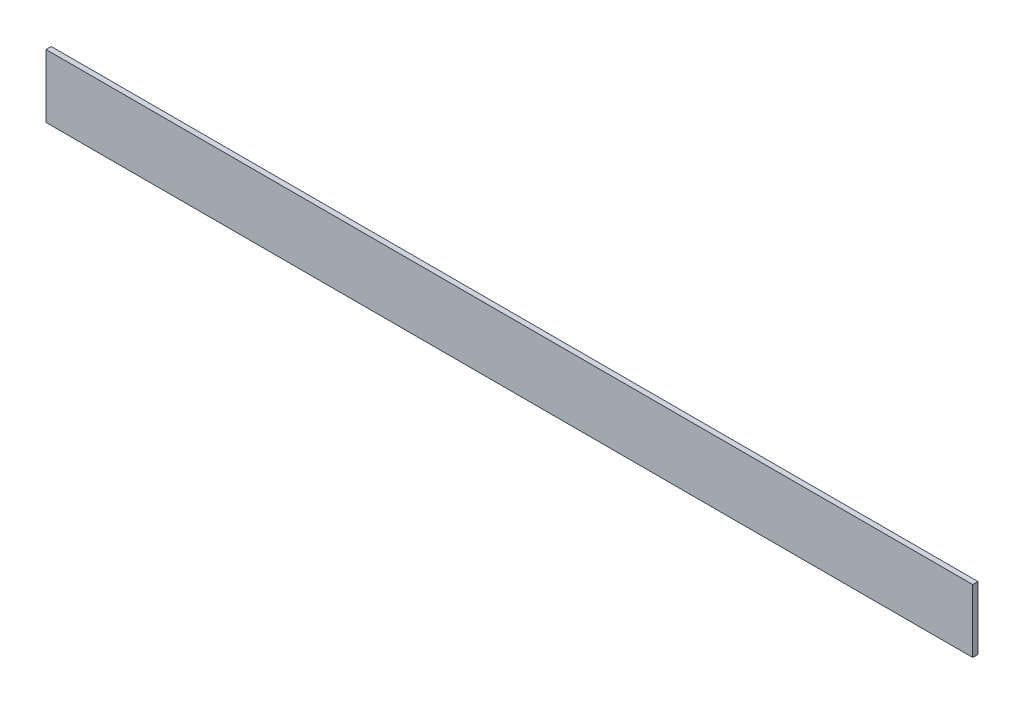
ISO-10303-21;
HEADER;
FILE_DESCRIPTION(('STEP AP214'),'2;1');
FILE_NAME('part.step','',(''),(''),'','','');
FILE_SCHEMA(('AUTOMOTIVE_DESIGN { 1 0 10303 214 1 1 1 1 }'));
ENDSEC;
DATA;
#1=APPLICATION_CONTEXT('core data for automotive mechanical design processes');
#2=APPLICATION_PROTOCOL_DEFINITION('international standard','automotive_design',2000,#1);
#3=PRODUCT_CONTEXT('',#1,'mechanical');
#4=PRODUCT('Part','Part','',(#3));
#5=PRODUCT_RELATED_PRODUCT_CATEGORY('part','',(#4));
#6=PRODUCT_DEFINITION_FORMATION('','',#4);
#7=PRODUCT_DEFINITION_CONTEXT('part definition',#1,'design');
#8=PRODUCT_DEFINITION('design','',#6,#7);
#9=PRODUCT_DEFINITION_SHAPE('','',#8);
#10=(LENGTH_UNIT() NAMED_UNIT(*) SI_UNIT(.MILLI.,.METRE.));
#11=(NAMED_UNIT(*) PLANE_ANGLE_UNIT() SI_UNIT($,.RADIAN.));
#12=(NAMED_UNIT(*) SI_UNIT($,.STERADIAN.) SOLID_ANGLE_UNIT());
#13=UNCERTAINTY_MEASURE_WITH_UNIT(LENGTH_MEASURE(1.E-05),#10,'distance_accuracy_value','');
#14=(GEOMETRIC_REPRESENTATION_CONTEXT(3) GLOBAL_UNCERTAINTY_ASSIGNED_CONTEXT((#13)) GLOBAL_UNIT_ASSIGNED_CONTEXT((#10,
#11,#12)) REPRESENTATION_CONTEXT('',''));
#15=CARTESIAN_POINT('',(0.,0.,0.));
#16=DIRECTION('',(0.,0.,1.));
#17=DIRECTION('',(1.,0.,0.));
#18=AXIS2_PLACEMENT_3D('',#15,#16,#17);
#19=CARTESIAN_POINT('',(1117.6,-38.1,-3.175));
#20=DIRECTION('',(0.,0.,1.));
#21=DIRECTION('',(1.,0.,0.));
#22=AXIS2_PLACEMENT_3D('',#19,#20,#21);
#23=PLANE('',#22);
#24=DIRECTION('',(0.,1.,0.));
#25=VECTOR('',#24,1.);
#26=CARTESIAN_POINT('',(0.,-38.1,-3.175));
#27=LINE('',#26,#25);
#28=CARTESIAN_POINT('',(0.,-38.1,-3.175));
#29=VERTEX_POINT('',#28);
#30=CARTESIAN_POINT('',(0.,38.1,-3.175));
#31=VERTEX_POINT('',#30);
#32=EDGE_CURVE('E98',#29,#31,#27,.T.);
#33=ORIENTED_EDGE('',*,*,#32,.T.);
#34=DIRECTION('',(-1.,0.,0.));
#35=VECTOR('',#34,1.);
#36=CARTESIAN_POINT('',(1117.6,38.1,-3.175));
#37=LINE('',#36,#35);
#38=CARTESIAN_POINT('',(1117.6,38.1,-3.175));
#39=VERTEX_POINT('',#38);
#40=EDGE_CURVE('E11',#39,#31,#37,.T.);
#41=ORIENTED_EDGE('',*,*,#40,.F.);
#42=DIRECTION('',(0.,1.,0.));
#43=VECTOR('',#42,1.);
#44=CARTESIAN_POINT('',(1117.6,-38.1,-3.175));
#45=LINE('',#44,#43);
#46=CARTESIAN_POINT('',(1117.6,-38.1,-3.175));
#47=VERTEX_POINT('',#46);
#48=EDGE_CURVE('E86',#47,#39,#45,.T.);
#49=ORIENTED_EDGE('',*,*,#48,.F.);
#50=DIRECTION('',(-1.,0.,0.));
#51=VECTOR('',#50,1.);
#52=CARTESIAN_POINT('',(1117.6,-38.1,-3.175));
#53=LINE('',#52,#51);
#54=EDGE_CURVE('E94',#47,#29,#53,.T.);
#55=ORIENTED_EDGE('',*,*,#54,.T.);
#56=EDGE_LOOP('',(#33,#41,#49,#55));
#57=FACE_BOUND('',#56,.T.);
#58=ADVANCED_FACE('F35',(#57),#23,.F.);
#59=CARTESIAN_POINT('',(1117.6,38.1,3.175));
#60=DIRECTION('',(0.,-1.,0.));
#61=DIRECTION('',(0.,0.,-1.));
#62=AXIS2_PLACEMENT_3D('',#59,#60,#61);
#63=PLANE('',#62);
#64=DIRECTION('',(0.,0.,1.));
#65=VECTOR('',#64,1.);
#66=CARTESIAN_POINT('',(0.,38.1,3.175));
#67=LINE('',#66,#65);
#68=CARTESIAN_POINT('',(0.,38.1,3.175));
#69=VERTEX_POINT('',#68);
#70=EDGE_CURVE('E90',#31,#69,#67,.T.);
#71=ORIENTED_EDGE('',*,*,#70,.T.);
#72=DIRECTION('',(-1.,0.,0.));
#73=VECTOR('',#72,1.);
#74=CARTESIAN_POINT('',(1117.6,38.1,3.175));
#75=LINE('',#74,#73);
#76=CARTESIAN_POINT('',(1117.6,38.1,3.175));
#77=VERTEX_POINT('',#76);
#78=EDGE_CURVE('E43',#77,#69,#75,.T.);
#79=ORIENTED_EDGE('',*,*,#78,.F.);
#80=DIRECTION('',(0.,0.,1.));
#81=VECTOR('',#80,1.);
#82=CARTESIAN_POINT('',(1117.6,38.1,3.175));
#83=LINE('',#82,#81);
#84=EDGE_CURVE('E81',#39,#77,#83,.T.);
#85=ORIENTED_EDGE('',*,*,#84,.F.);
#86=ORIENTED_EDGE('',*,*,#40,.T.);
#87=EDGE_LOOP('',(#71,#79,#85,#86));
#88=FACE_BOUND('',#87,.T.);
#89=ADVANCED_FACE('F89',(#88),#63,.F.);
#90=CARTESIAN_POINT('',(1117.6,-38.1,3.175));
#91=DIRECTION('',(0.,0.,-1.));
#92=DIRECTION('',(-1.,0.,0.));
#93=AXIS2_PLACEMENT_3D('',#90,#91,#92);
#94=PLANE('',#93);
#95=DIRECTION('',(0.,-1.,0.));
#96=VECTOR('',#95,1.);
#97=CARTESIAN_POINT('',(0.,-38.1,3.175));
#98=LINE('',#97,#96);
#99=CARTESIAN_POINT('',(0.,-38.1,3.175));
#100=VERTEX_POINT('',#99);
#101=EDGE_CURVE('E68',#69,#100,#98,.T.);
#102=ORIENTED_EDGE('',*,*,#101,.T.);
#103=DIRECTION('',(-1.,0.,0.));
#104=VECTOR('',#103,1.);
#105=CARTESIAN_POINT('',(1117.6,-38.1,3.175));
#106=LINE('',#105,#104);
#107=CARTESIAN_POINT('',(1117.6,-38.1,3.175));
#108=VERTEX_POINT('',#107);
#109=EDGE_CURVE('E91',#108,#100,#106,.T.);
#110=ORIENTED_EDGE('',*,*,#109,.F.);
#111=DIRECTION('',(0.,-1.,0.));
#112=VECTOR('',#111,1.);
#113=CARTESIAN_POINT('',(1117.6,-38.1,3.175));
#114=LINE('',#113,#112);
#115=EDGE_CURVE('E84',#77,#108,#114,.T.);
#116=ORIENTED_EDGE('',*,*,#115,.F.);
#117=ORIENTED_EDGE('',*,*,#78,.T.);
#118=EDGE_LOOP('',(#102,#110,#116,#117));
#119=FACE_BOUND('',#118,.T.);
#120=ADVANCED_FACE('F92',(#119),#94,.F.);
#121=CARTESIAN_POINT('',(1117.6,-38.1,3.175));
#122=DIRECTION('',(0.,1.,0.));
#123=DIRECTION('',(0.,0.,1.));
#124=AXIS2_PLACEMENT_3D('',#121,#122,#123);
#125=PLANE('',#124);
#126=DIRECTION('',(0.,0.,-1.));
#127=VECTOR('',#126,1.);
#128=CARTESIAN_POINT('',(0.,-38.1,3.175));
#129=LINE('',#128,#127);
#130=EDGE_CURVE('E74',#100,#29,#129,.T.);
#131=ORIENTED_EDGE('',*,*,#130,.T.);
#132=ORIENTED_EDGE('',*,*,#54,.F.);
#133=DIRECTION('',(0.,0.,-1.));
#134=VECTOR('',#133,1.);
#135=CARTESIAN_POINT('',(1117.6,-38.1,3.175));
#136=LINE('',#135,#134);
#137=EDGE_CURVE('E51',#108,#47,#136,.T.);
#138=ORIENTED_EDGE('',*,*,#137,.F.);
#139=ORIENTED_EDGE('',*,*,#109,.T.);
#140=EDGE_LOOP('',(#131,#132,#138,#139));
#141=FACE_BOUND('',#140,.T.);
#142=ADVANCED_FACE('F105',(#141),#125,.F.);
#143=CARTESIAN_POINT('',(1117.6,0.,0.));
#144=DIRECTION('',(-1.,0.,0.));
#145=DIRECTION('',(0.,0.,1.));
#146=AXIS2_PLACEMENT_3D('',#143,#144,#145);
#147=PLANE('',#146);
#148=ORIENTED_EDGE('',*,*,#48,.T.);
#149=ORIENTED_EDGE('',*,*,#84,.T.);
#150=ORIENTED_EDGE('',*,*,#115,.T.);
#151=ORIENTED_EDGE('',*,*,#137,.T.);
#152=EDGE_LOOP('',(#148,#149,#150,#151));
#153=FACE_BOUND('',#152,.T.);
#154=ADVANCED_FACE('F82',(#153),#147,.F.);
#155=CARTESIAN_POINT('',(0.,0.,0.));
#156=DIRECTION('',(-1.,0.,0.));
#157=DIRECTION('',(0.,0.,1.));
#158=AXIS2_PLACEMENT_3D('',#155,#156,#157);
#159=PLANE('',#158);
#160=ORIENTED_EDGE('',*,*,#32,.F.);
#161=ORIENTED_EDGE('',*,*,#130,.F.);
#162=ORIENTED_EDGE('',*,*,#101,.F.);
#163=ORIENTED_EDGE('',*,*,#70,.F.);
#164=EDGE_LOOP('',(#160,#161,#162,#163));
#165=FACE_BOUND('',#164,.T.);
#166=ADVANCED_FACE('F108',(#165),#159,.T.);
#167=CLOSED_SHELL('',(#58,#89,#120,#142,#154,#166));
#168=MANIFOLD_SOLID_BREP('B2',#167);
#169=ADVANCED_BREP_SHAPE_REPRESENTATION('',(#18,#168),#14);
#170=SHAPE_DEFINITION_REPRESENTATION(#9,#169);
ENDSEC;
END-ISO-10303-21;
